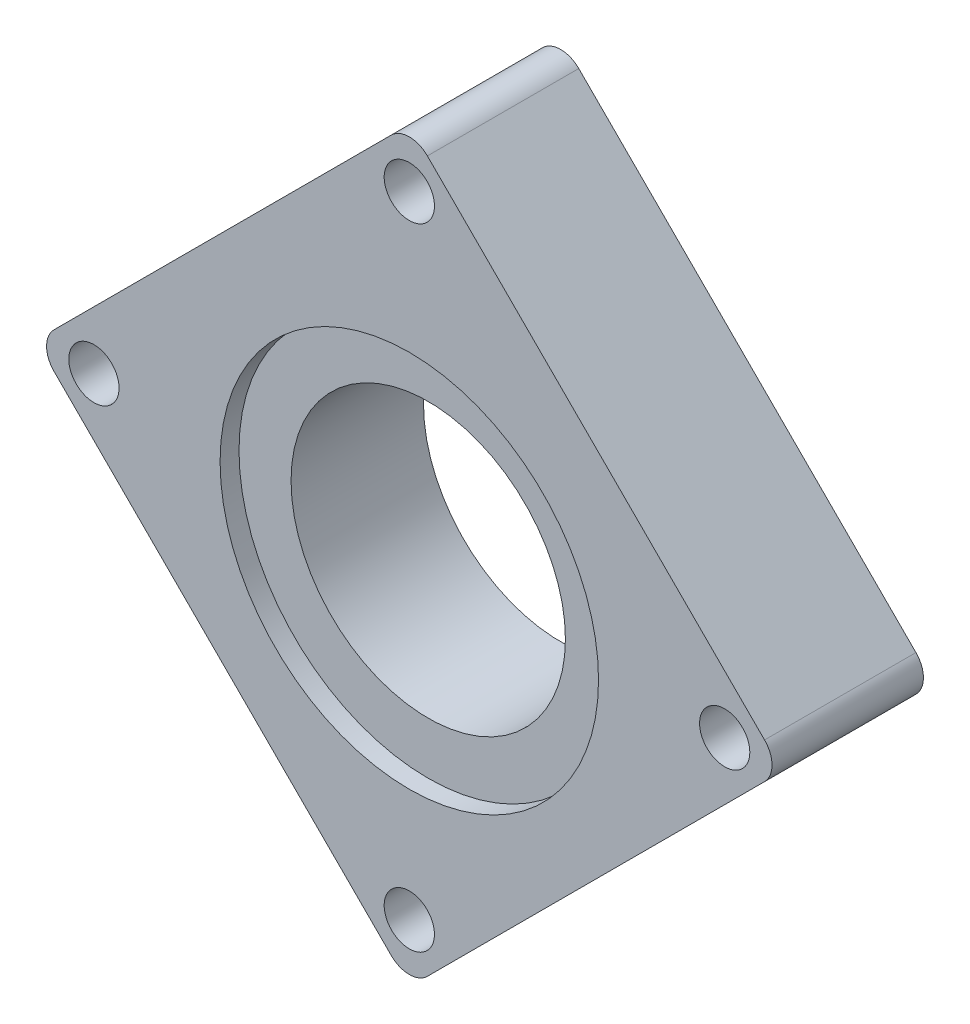
ISO-10303-21;
HEADER;
FILE_DESCRIPTION(('STEP AP214'),'2;1');
FILE_NAME('part.step','',(''),(''),'','','');
FILE_SCHEMA(('AUTOMOTIVE_DESIGN { 1 0 10303 214 1 1 1 1 }'));
ENDSEC;
DATA;
#1=APPLICATION_CONTEXT('core data for automotive mechanical design processes');
#2=APPLICATION_PROTOCOL_DEFINITION('international standard','automotive_design',2000,#1);
#3=PRODUCT_CONTEXT('',#1,'mechanical');
#4=PRODUCT('Part','Part','',(#3));
#5=PRODUCT_RELATED_PRODUCT_CATEGORY('part','',(#4));
#6=PRODUCT_DEFINITION_FORMATION('','',#4);
#7=PRODUCT_DEFINITION_CONTEXT('part definition',#1,'design');
#8=PRODUCT_DEFINITION('design','',#6,#7);
#9=PRODUCT_DEFINITION_SHAPE('','',#8);
#10=(LENGTH_UNIT() NAMED_UNIT(*) SI_UNIT(.MILLI.,.METRE.));
#11=(NAMED_UNIT(*) PLANE_ANGLE_UNIT() SI_UNIT($,.RADIAN.));
#12=(NAMED_UNIT(*) SI_UNIT($,.STERADIAN.) SOLID_ANGLE_UNIT());
#13=UNCERTAINTY_MEASURE_WITH_UNIT(LENGTH_MEASURE(1.E-05),#10,'distance_accuracy_value','');
#14=(GEOMETRIC_REPRESENTATION_CONTEXT(3) GLOBAL_UNCERTAINTY_ASSIGNED_CONTEXT((#13)) GLOBAL_UNIT_ASSIGNED_CONTEXT((#10,
#11,#12)) REPRESENTATION_CONTEXT('',''));
#15=CARTESIAN_POINT('',(0.,0.,0.));
#16=DIRECTION('',(0.,0.,1.));
#17=DIRECTION('',(1.,0.,0.));
#18=AXIS2_PLACEMENT_3D('',#15,#16,#17);
#19=CARTESIAN_POINT('',(58.9093516025737,45.0772658132579,16.));
#20=DIRECTION('',(0.,0.,-1.));
#21=DIRECTION('',(-1.,0.,0.));
#22=AXIS2_PLACEMENT_3D('',#19,#20,#21);
#23=CYLINDRICAL_SURFACE('',#22,14.5);
#24=CARTESIAN_POINT('',(58.9093516025737,45.0772658132579,0.));
#25=DIRECTION('',(0.,0.,1.));
#26=DIRECTION('',(1.,0.,0.));
#27=AXIS2_PLACEMENT_3D('',#24,#25,#26);
#28=CIRCLE('',#27,14.5);
#29=CARTESIAN_POINT('',(73.4093516025737,45.0772658132579,0.));
#30=VERTEX_POINT('',#29);
#31=EDGE_CURVE('E135',#30,#30,#28,.T.);
#32=ORIENTED_EDGE('',*,*,#31,.F.);
#33=EDGE_LOOP('',(#32));
#34=FACE_BOUND('',#33,.T.);
#35=CARTESIAN_POINT('',(58.9093516025737,45.0772658132579,14.));
#36=DIRECTION('',(0.,0.,1.));
#37=DIRECTION('',(1.,0.,0.));
#38=AXIS2_PLACEMENT_3D('',#35,#36,#37);
#39=CIRCLE('',#38,14.5);
#40=CARTESIAN_POINT('',(73.4093516025737,45.0772658132579,14.));
#41=VERTEX_POINT('',#40);
#42=EDGE_CURVE('E36',#41,#41,#39,.T.);
#43=ORIENTED_EDGE('',*,*,#42,.T.);
#44=EDGE_LOOP('',(#43));
#45=FACE_BOUND('',#44,.T.);
#46=ADVANCED_FACE('F32',(#34,#45),#23,.F.);
#47=CARTESIAN_POINT('',(94.5475333743754,46.4576834611031,16.));
#48=DIRECTION('',(0.,0.,1.));
#49=DIRECTION('',(1.,0.,0.));
#50=AXIS2_PLACEMENT_3D('',#47,#48,#49);
#51=PLANE('',#50);
#52=CARTESIAN_POINT('',(58.9093516025737,45.0772658132579,16.));
#53=DIRECTION('',(0.,0.,1.));
#54=DIRECTION('',(1.,0.,0.));
#55=AXIS2_PLACEMENT_3D('',#52,#53,#54);
#56=CIRCLE('',#55,20.);
#57=CARTESIAN_POINT('',(78.9093516025737,45.0772658132579,16.));
#58=VERTEX_POINT('',#57);
#59=EDGE_CURVE('E207',#58,#58,#56,.T.);
#60=ORIENTED_EDGE('',*,*,#59,.F.);
#61=EDGE_LOOP('',(#60));
#62=FACE_BOUND('',#61,.T.);
#63=CARTESIAN_POINT('',(58.9093516025736,79.7906971262372,16.));
#64=DIRECTION('',(0.,0.,1.));
#65=DIRECTION('',(1.,0.,0.));
#66=AXIS2_PLACEMENT_3D('',#63,#64,#65);
#67=CIRCLE('',#66,2.65560296279747);
#68=CARTESIAN_POINT('',(61.564954565371,79.7906971262372,16.));
#69=VERTEX_POINT('',#68);
#70=EDGE_CURVE('E193',#69,#69,#67,.T.);
#71=ORIENTED_EDGE('',*,*,#70,.F.);
#72=EDGE_LOOP('',(#71));
#73=FACE_BOUND('',#72,.T.);
#74=CARTESIAN_POINT('',(58.9093516025732,13.1246697959693,16.));
#75=DIRECTION('',(0.,0.,1.));
#76=DIRECTION('',(1.,0.,0.));
#77=AXIS2_PLACEMENT_3D('',#74,#75,#76);
#78=CIRCLE('',#77,2.65560296279745);
#79=CARTESIAN_POINT('',(61.5649545653707,13.1246697959693,16.));
#80=VERTEX_POINT('',#79);
#81=EDGE_CURVE('E183',#80,#80,#78,.T.);
#82=ORIENTED_EDGE('',*,*,#81,.F.);
#83=EDGE_LOOP('',(#82));
#84=FACE_BOUND('',#83,.T.);
#85=CARTESIAN_POINT('',(94.5475333743754,46.4576834611031,16.));
#86=DIRECTION('',(0.,0.,1.));
#87=DIRECTION('',(1.,0.,0.));
#88=AXIS2_PLACEMENT_3D('',#85,#86,#87);
#89=CIRCLE('',#88,2.7);
#90=CARTESIAN_POINT('',(96.4567216835791,44.5484951518994,16.));
#91=VERTEX_POINT('',#90);
#92=CARTESIAN_POINT('',(96.4567216835791,48.3668717703068,16.));
#93=VERTEX_POINT('',#92);
#94=EDGE_CURVE('E149',#91,#93,#89,.T.);
#95=ORIENTED_EDGE('',*,*,#94,.T.);
#96=DIRECTION('',(-0.707106781186543,0.707106781186552,0.));
#97=VECTOR('',#96,1.);
#98=CARTESIAN_POINT('',(96.4567216835791,48.3668717703068,16.));
#99=LINE('',#98,#97);
#100=CARTESIAN_POINT('',(60.8185399117773,84.005053542109,16.));
#101=VERTEX_POINT('',#100);
#102=EDGE_CURVE('E91',#93,#101,#99,.T.);
#103=ORIENTED_EDGE('',*,*,#102,.T.);
#104=CARTESIAN_POINT('',(58.9093516025737,82.0958652329053,16.));
#105=DIRECTION('',(0.,0.,1.));
#106=DIRECTION('',(1.,0.,0.));
#107=AXIS2_PLACEMENT_3D('',#104,#105,#106);
#108=CIRCLE('',#107,2.69999999999999);
#109=CARTESIAN_POINT('',(57.00016329337,84.005053542109,16.));
#110=VERTEX_POINT('',#109);
#111=EDGE_CURVE('E165',#101,#110,#108,.T.);
#112=ORIENTED_EDGE('',*,*,#111,.T.);
#113=DIRECTION('',(-0.707106781186552,-0.707106781186543,0.));
#114=VECTOR('',#113,1.);
#115=CARTESIAN_POINT('',(57.00016329337,84.005053542109,16.));
#116=LINE('',#115,#114);
#117=CARTESIAN_POINT('',(21.3619815215678,48.3668717703072,16.));
#118=VERTEX_POINT('',#117);
#119=EDGE_CURVE('E175',#110,#118,#116,.T.);
#120=ORIENTED_EDGE('',*,*,#119,.T.);
#121=CARTESIAN_POINT('',(23.2711698307715,46.4576834611035,16.));
#122=DIRECTION('',(0.,0.,1.));
#123=DIRECTION('',(1.,0.,0.));
#124=AXIS2_PLACEMENT_3D('',#121,#122,#123);
#125=CIRCLE('',#124,2.70000000000001);
#126=CARTESIAN_POINT('',(21.3619815215678,44.5484951518999,16.));
#127=VERTEX_POINT('',#126);
#128=EDGE_CURVE('E112',#118,#127,#125,.T.);
#129=ORIENTED_EDGE('',*,*,#128,.T.);
#130=DIRECTION('',(0.707106781186543,-0.707106781186552,0.));
#131=VECTOR('',#130,1.);
#132=CARTESIAN_POINT('',(21.3619815215678,44.5484951518999,16.));
#133=LINE('',#132,#131);
#134=CARTESIAN_POINT('',(57.0001632933695,8.91031338009766,16.));
#135=VERTEX_POINT('',#134);
#136=EDGE_CURVE('E104',#127,#135,#133,.T.);
#137=ORIENTED_EDGE('',*,*,#136,.T.);
#138=CARTESIAN_POINT('',(58.9093516025732,10.8195016893013,16.));
#139=DIRECTION('',(0.,0.,1.));
#140=DIRECTION('',(1.,0.,0.));
#141=AXIS2_PLACEMENT_3D('',#138,#139,#140);
#142=CIRCLE('',#141,2.7);
#143=CARTESIAN_POINT('',(60.8185399117769,8.91031338009764,16.));
#144=VERTEX_POINT('',#143);
#145=EDGE_CURVE('E109',#135,#144,#142,.T.);
#146=ORIENTED_EDGE('',*,*,#145,.T.);
#147=DIRECTION('',(0.707106781186552,0.707106781186543,0.));
#148=VECTOR('',#147,1.);
#149=CARTESIAN_POINT('',(60.8185399117769,8.91031338009764,16.));
#150=LINE('',#149,#148);
#151=EDGE_CURVE('E50',#144,#91,#150,.T.);
#152=ORIENTED_EDGE('',*,*,#151,.T.);
#153=EDGE_LOOP('',(#95,#103,#112,#120,#129,#137,#146,#152));
#154=FACE_BOUND('',#153,.T.);
#155=CARTESIAN_POINT('',(92.2423652677073,46.4576834611031,16.));
#156=DIRECTION('',(0.,0.,1.));
#157=DIRECTION('',(1.,0.,0.));
#158=AXIS2_PLACEMENT_3D('',#155,#156,#157);
#159=CIRCLE('',#158,2.65560296279748);
#160=CARTESIAN_POINT('',(94.8979682305048,46.4576834611031,16.));
#161=VERTEX_POINT('',#160);
#162=EDGE_CURVE('E187',#161,#161,#159,.T.);
#163=ORIENTED_EDGE('',*,*,#162,.F.);
#164=EDGE_LOOP('',(#163));
#165=FACE_BOUND('',#164,.T.);
#166=CARTESIAN_POINT('',(25.5763379374397,46.4576834611035,16.));
#167=DIRECTION('',(0.,0.,1.));
#168=DIRECTION('',(1.,0.,0.));
#169=AXIS2_PLACEMENT_3D('',#166,#167,#168);
#170=CIRCLE('',#169,2.65560296279746);
#171=CARTESIAN_POINT('',(28.2319409002371,46.4576834611035,16.));
#172=VERTEX_POINT('',#171);
#173=EDGE_CURVE('E199',#172,#172,#170,.T.);
#174=ORIENTED_EDGE('',*,*,#173,.F.);
#175=EDGE_LOOP('',(#174));
#176=FACE_BOUND('',#175,.T.);
#177=ADVANCED_FACE('F106',(#62,#73,#84,#154,#165,#176),#51,.T.);
#178=CARTESIAN_POINT('',(94.5475333743754,46.4576834611031,0.));
#179=DIRECTION('',(0.,0.,1.));
#180=DIRECTION('',(1.,0.,0.));
#181=AXIS2_PLACEMENT_3D('',#178,#179,#180);
#182=PLANE('',#181);
#183=CARTESIAN_POINT('',(94.5475333743754,46.4576834611031,0.));
#184=DIRECTION('',(0.,0.,1.));
#185=DIRECTION('',(1.,0.,0.));
#186=AXIS2_PLACEMENT_3D('',#183,#184,#185);
#187=CIRCLE('',#186,2.7);
#188=CARTESIAN_POINT('',(96.4567216835791,44.5484951518994,0.));
#189=VERTEX_POINT('',#188);
#190=CARTESIAN_POINT('',(96.4567216835791,48.3668717703068,0.));
#191=VERTEX_POINT('',#190);
#192=EDGE_CURVE('E131',#189,#191,#187,.T.);
#193=ORIENTED_EDGE('',*,*,#192,.F.);
#194=DIRECTION('',(0.707106781186552,0.707106781186543,0.));
#195=VECTOR('',#194,1.);
#196=CARTESIAN_POINT('',(92.4262130308157,40.5179864991361,0.));
#197=LINE('',#196,#195);
#198=CARTESIAN_POINT('',(60.8185399117769,8.91031338009764,0.));
#199=VERTEX_POINT('',#198);
#200=EDGE_CURVE('E79',#199,#189,#197,.T.);
#201=ORIENTED_EDGE('',*,*,#200,.F.);
#202=CARTESIAN_POINT('',(58.9093516025732,10.8195016893013,0.));
#203=DIRECTION('',(0.,0.,1.));
#204=DIRECTION('',(1.,0.,0.));
#205=AXIS2_PLACEMENT_3D('',#202,#203,#204);
#206=CIRCLE('',#205,2.7);
#207=CARTESIAN_POINT('',(57.0001632933695,8.91031338009766,0.));
#208=VERTEX_POINT('',#207);
#209=EDGE_CURVE('E146',#208,#199,#206,.T.);
#210=ORIENTED_EDGE('',*,*,#209,.F.);
#211=DIRECTION('',(0.707106781186543,-0.707106781186552,0.));
#212=VECTOR('',#211,1.);
#213=CARTESIAN_POINT('',(52.9696546406062,12.940822032861,0.));
#214=LINE('',#213,#212);
#215=CARTESIAN_POINT('',(21.3619815215678,44.5484951518999,0.));
#216=VERTEX_POINT('',#215);
#217=EDGE_CURVE('E120',#216,#208,#214,.T.);
#218=ORIENTED_EDGE('',*,*,#217,.F.);
#219=CARTESIAN_POINT('',(23.2711698307715,46.4576834611035,0.));
#220=DIRECTION('',(0.,0.,1.));
#221=DIRECTION('',(1.,0.,0.));
#222=AXIS2_PLACEMENT_3D('',#219,#220,#221);
#223=CIRCLE('',#222,2.70000000000001);
#224=CARTESIAN_POINT('',(21.3619815215678,48.3668717703072,0.));
#225=VERTEX_POINT('',#224);
#226=EDGE_CURVE('E142',#225,#216,#223,.T.);
#227=ORIENTED_EDGE('',*,*,#226,.F.);
#228=DIRECTION('',(-0.707106781186553,-0.707106781186542,0.));
#229=VECTOR('',#228,1.);
#230=CARTESIAN_POINT('',(25.3924901743311,52.3973804230705,0.));
#231=LINE('',#230,#229);
#232=CARTESIAN_POINT('',(57.00016329337,84.005053542109,0.));
#233=VERTEX_POINT('',#232);
#234=EDGE_CURVE('E140',#233,#225,#231,.T.);
#235=ORIENTED_EDGE('',*,*,#234,.F.);
#236=CARTESIAN_POINT('',(58.9093516025737,82.0958652329053,0.));
#237=DIRECTION('',(0.,0.,1.));
#238=DIRECTION('',(1.,0.,0.));
#239=AXIS2_PLACEMENT_3D('',#236,#237,#238);
#240=CIRCLE('',#239,2.69999999999999);
#241=CARTESIAN_POINT('',(60.8185399117773,84.005053542109,0.));
#242=VERTEX_POINT('',#241);
#243=EDGE_CURVE('E137',#242,#233,#240,.T.);
#244=ORIENTED_EDGE('',*,*,#243,.F.);
#245=DIRECTION('',(-0.707106781186543,0.707106781186552,0.));
#246=VECTOR('',#245,1.);
#247=CARTESIAN_POINT('',(64.8490485645406,79.9745448893457,0.));
#248=LINE('',#247,#246);
#249=EDGE_CURVE('E134',#191,#242,#248,.T.);
#250=ORIENTED_EDGE('',*,*,#249,.F.);
#251=EDGE_LOOP('',(#193,#201,#210,#218,#227,#235,#244,#250));
#252=FACE_BOUND('',#251,.T.);
#253=ORIENTED_EDGE('',*,*,#31,.T.);
#254=EDGE_LOOP('',(#253));
#255=FACE_BOUND('',#254,.T.);
#256=CARTESIAN_POINT('',(58.9093516025732,13.1246697959693,0.));
#257=DIRECTION('',(0.,0.,1.));
#258=DIRECTION('',(1.,0.,0.));
#259=AXIS2_PLACEMENT_3D('',#256,#257,#258);
#260=CIRCLE('',#259,2.65560296279745);
#261=CARTESIAN_POINT('',(61.5649545653707,13.1246697959693,0.));
#262=VERTEX_POINT('',#261);
#263=EDGE_CURVE('E184',#262,#262,#260,.T.);
#264=ORIENTED_EDGE('',*,*,#263,.T.);
#265=EDGE_LOOP('',(#264));
#266=FACE_BOUND('',#265,.T.);
#267=CARTESIAN_POINT('',(92.2423652677073,46.4576834611031,0.));
#268=DIRECTION('',(0.,0.,1.));
#269=DIRECTION('',(1.,0.,0.));
#270=AXIS2_PLACEMENT_3D('',#267,#268,#269);
#271=CIRCLE('',#270,2.65560296279748);
#272=CARTESIAN_POINT('',(94.8979682305048,46.4576834611031,0.));
#273=VERTEX_POINT('',#272);
#274=EDGE_CURVE('E190',#273,#273,#271,.T.);
#275=ORIENTED_EDGE('',*,*,#274,.T.);
#276=EDGE_LOOP('',(#275));
#277=FACE_BOUND('',#276,.T.);
#278=CARTESIAN_POINT('',(58.9093516025736,79.7906971262372,0.));
#279=DIRECTION('',(0.,0.,1.));
#280=DIRECTION('',(1.,0.,0.));
#281=AXIS2_PLACEMENT_3D('',#278,#279,#280);
#282=CIRCLE('',#281,2.65560296279747);
#283=CARTESIAN_POINT('',(61.564954565371,79.7906971262372,0.));
#284=VERTEX_POINT('',#283);
#285=EDGE_CURVE('E196',#284,#284,#282,.T.);
#286=ORIENTED_EDGE('',*,*,#285,.T.);
#287=EDGE_LOOP('',(#286));
#288=FACE_BOUND('',#287,.T.);
#289=CARTESIAN_POINT('',(25.5763379374397,46.4576834611035,0.));
#290=DIRECTION('',(0.,0.,1.));
#291=DIRECTION('',(1.,0.,0.));
#292=AXIS2_PLACEMENT_3D('',#289,#290,#291);
#293=CIRCLE('',#292,2.65560296279746);
#294=CARTESIAN_POINT('',(28.2319409002371,46.4576834611035,0.));
#295=VERTEX_POINT('',#294);
#296=EDGE_CURVE('E202',#295,#295,#293,.T.);
#297=ORIENTED_EDGE('',*,*,#296,.T.);
#298=EDGE_LOOP('',(#297));
#299=FACE_BOUND('',#298,.T.);
#300=ADVANCED_FACE('F166',(#252,#255,#266,#277,#288,#299),#182,.F.);
#301=CARTESIAN_POINT('',(94.5475333743754,46.4576834611031,16.));
#302=DIRECTION('',(0.,0.,-1.));
#303=DIRECTION('',(-1.,0.,0.));
#304=AXIS2_PLACEMENT_3D('',#301,#302,#303);
#305=CYLINDRICAL_SURFACE('',#304,2.7);
#306=ORIENTED_EDGE('',*,*,#192,.T.);
#307=DIRECTION('',(0.,0.,-1.));
#308=VECTOR('',#307,1.);
#309=CARTESIAN_POINT('',(96.4567216835791,48.3668717703068,16.));
#310=LINE('',#309,#308);
#311=EDGE_CURVE('E11',#93,#191,#310,.T.);
#312=ORIENTED_EDGE('',*,*,#311,.F.);
#313=ORIENTED_EDGE('',*,*,#94,.F.);
#314=DIRECTION('',(0.,0.,-1.));
#315=VECTOR('',#314,1.);
#316=CARTESIAN_POINT('',(96.4567216835791,44.5484951518994,16.));
#317=LINE('',#316,#315);
#318=EDGE_CURVE('E127',#91,#189,#317,.T.);
#319=ORIENTED_EDGE('',*,*,#318,.T.);
#320=EDGE_LOOP('',(#306,#312,#313,#319));
#321=FACE_BOUND('',#320,.T.);
#322=ADVANCED_FACE('F34',(#321),#305,.T.);
#323=CARTESIAN_POINT('',(64.8490485645406,79.9745448893457,16.));
#324=DIRECTION('',(-0.707106781186552,-0.707106781186543,0.));
#325=DIRECTION('',(0.707106781186543,-0.707106781186552,0.));
#326=AXIS2_PLACEMENT_3D('',#323,#324,#325);
#327=PLANE('',#326);
#328=ORIENTED_EDGE('',*,*,#249,.T.);
#329=DIRECTION('',(0.,0.,-1.));
#330=VECTOR('',#329,1.);
#331=CARTESIAN_POINT('',(60.8185399117773,84.005053542109,16.));
#332=LINE('',#331,#330);
#333=EDGE_CURVE('E42',#101,#242,#332,.T.);
#334=ORIENTED_EDGE('',*,*,#333,.F.);
#335=ORIENTED_EDGE('',*,*,#102,.F.);
#336=ORIENTED_EDGE('',*,*,#311,.T.);
#337=EDGE_LOOP('',(#328,#334,#335,#336));
#338=FACE_BOUND('',#337,.T.);
#339=ADVANCED_FACE('F255',(#338),#327,.F.);
#340=CARTESIAN_POINT('',(58.9093516025737,82.0958652329053,16.));
#341=DIRECTION('',(0.,0.,-1.));
#342=DIRECTION('',(-1.,0.,0.));
#343=AXIS2_PLACEMENT_3D('',#340,#341,#342);
#344=CYLINDRICAL_SURFACE('',#343,2.69999999999999);
#345=ORIENTED_EDGE('',*,*,#243,.T.);
#346=DIRECTION('',(0.,0.,-1.));
#347=VECTOR('',#346,1.);
#348=CARTESIAN_POINT('',(57.00016329337,84.005053542109,16.));
#349=LINE('',#348,#347);
#350=EDGE_CURVE('E156',#110,#233,#349,.T.);
#351=ORIENTED_EDGE('',*,*,#350,.F.);
#352=ORIENTED_EDGE('',*,*,#111,.F.);
#353=ORIENTED_EDGE('',*,*,#333,.T.);
#354=EDGE_LOOP('',(#345,#351,#352,#353));
#355=FACE_BOUND('',#354,.T.);
#356=ADVANCED_FACE('F163',(#355),#344,.T.);
#357=CARTESIAN_POINT('',(25.3924901743311,52.3973804230705,16.));
#358=DIRECTION('',(0.707106781186542,-0.707106781186553,0.));
#359=DIRECTION('',(0.707106781186553,0.707106781186542,0.));
#360=AXIS2_PLACEMENT_3D('',#357,#358,#359);
#361=PLANE('',#360);
#362=ORIENTED_EDGE('',*,*,#234,.T.);
#363=DIRECTION('',(0.,0.,-1.));
#364=VECTOR('',#363,1.);
#365=CARTESIAN_POINT('',(21.3619815215678,48.3668717703072,16.));
#366=LINE('',#365,#364);
#367=EDGE_CURVE('E153',#118,#225,#366,.T.);
#368=ORIENTED_EDGE('',*,*,#367,.F.);
#369=ORIENTED_EDGE('',*,*,#119,.F.);
#370=ORIENTED_EDGE('',*,*,#350,.T.);
#371=EDGE_LOOP('',(#362,#368,#369,#370));
#372=FACE_BOUND('',#371,.T.);
#373=ADVANCED_FACE('F171',(#372),#361,.F.);
#374=CARTESIAN_POINT('',(23.2711698307715,46.4576834611035,16.));
#375=DIRECTION('',(0.,0.,-1.));
#376=DIRECTION('',(-1.,0.,0.));
#377=AXIS2_PLACEMENT_3D('',#374,#375,#376);
#378=CYLINDRICAL_SURFACE('',#377,2.70000000000001);
#379=ORIENTED_EDGE('',*,*,#226,.T.);
#380=DIRECTION('',(0.,0.,-1.));
#381=VECTOR('',#380,1.);
#382=CARTESIAN_POINT('',(21.3619815215678,44.5484951518999,16.));
#383=LINE('',#382,#381);
#384=EDGE_CURVE('E122',#127,#216,#383,.T.);
#385=ORIENTED_EDGE('',*,*,#384,.F.);
#386=ORIENTED_EDGE('',*,*,#128,.F.);
#387=ORIENTED_EDGE('',*,*,#367,.T.);
#388=EDGE_LOOP('',(#379,#385,#386,#387));
#389=FACE_BOUND('',#388,.T.);
#390=ADVANCED_FACE('F174',(#389),#378,.T.);
#391=CARTESIAN_POINT('',(52.9696546406062,12.940822032861,16.));
#392=DIRECTION('',(0.707106781186552,0.707106781186543,0.));
#393=DIRECTION('',(-0.707106781186543,0.707106781186552,0.));
#394=AXIS2_PLACEMENT_3D('',#391,#392,#393);
#395=PLANE('',#394);
#396=ORIENTED_EDGE('',*,*,#217,.T.);
#397=DIRECTION('',(0.,0.,-1.));
#398=VECTOR('',#397,1.);
#399=CARTESIAN_POINT('',(57.0001632933695,8.91031338009766,16.));
#400=LINE('',#399,#398);
#401=EDGE_CURVE('E118',#135,#208,#400,.T.);
#402=ORIENTED_EDGE('',*,*,#401,.F.);
#403=ORIENTED_EDGE('',*,*,#136,.F.);
#404=ORIENTED_EDGE('',*,*,#384,.T.);
#405=EDGE_LOOP('',(#396,#402,#403,#404));
#406=FACE_BOUND('',#405,.T.);
#407=ADVANCED_FACE('F119',(#406),#395,.F.);
#408=CARTESIAN_POINT('',(58.9093516025732,10.8195016893013,16.));
#409=DIRECTION('',(0.,0.,-1.));
#410=DIRECTION('',(-1.,0.,0.));
#411=AXIS2_PLACEMENT_3D('',#408,#409,#410);
#412=CYLINDRICAL_SURFACE('',#411,2.7);
#413=ORIENTED_EDGE('',*,*,#209,.T.);
#414=DIRECTION('',(0.,0.,-1.));
#415=VECTOR('',#414,1.);
#416=CARTESIAN_POINT('',(60.8185399117769,8.91031338009764,16.));
#417=LINE('',#416,#415);
#418=EDGE_CURVE('E123',#144,#199,#417,.T.);
#419=ORIENTED_EDGE('',*,*,#418,.F.);
#420=ORIENTED_EDGE('',*,*,#145,.F.);
#421=ORIENTED_EDGE('',*,*,#401,.T.);
#422=EDGE_LOOP('',(#413,#419,#420,#421));
#423=FACE_BOUND('',#422,.T.);
#424=ADVANCED_FACE('F125',(#423),#412,.T.);
#425=CARTESIAN_POINT('',(92.4262130308157,40.5179864991361,16.));
#426=DIRECTION('',(-0.707106781186543,0.707106781186552,0.));
#427=DIRECTION('',(-0.707106781186552,-0.707106781186543,0.));
#428=AXIS2_PLACEMENT_3D('',#425,#426,#427);
#429=PLANE('',#428);
#430=ORIENTED_EDGE('',*,*,#200,.T.);
#431=ORIENTED_EDGE('',*,*,#318,.F.);
#432=ORIENTED_EDGE('',*,*,#151,.F.);
#433=ORIENTED_EDGE('',*,*,#418,.T.);
#434=EDGE_LOOP('',(#430,#431,#432,#433));
#435=FACE_BOUND('',#434,.T.);
#436=ADVANCED_FACE('F243',(#435),#429,.F.);
#437=CARTESIAN_POINT('',(58.9093516025732,13.1246697959693,16.));
#438=DIRECTION('',(0.,0.,-1.));
#439=DIRECTION('',(-1.,0.,0.));
#440=AXIS2_PLACEMENT_3D('',#437,#438,#439);
#441=CYLINDRICAL_SURFACE('',#440,2.65560296279745);
#442=ORIENTED_EDGE('',*,*,#81,.T.);
#443=EDGE_LOOP('',(#442));
#444=FACE_BOUND('',#443,.T.);
#445=ORIENTED_EDGE('',*,*,#263,.F.);
#446=EDGE_LOOP('',(#445));
#447=FACE_BOUND('',#446,.T.);
#448=ADVANCED_FACE('F238',(#444,#447),#441,.F.);
#449=CARTESIAN_POINT('',(92.2423652677073,46.4576834611031,16.));
#450=DIRECTION('',(0.,0.,-1.));
#451=DIRECTION('',(-1.,0.,0.));
#452=AXIS2_PLACEMENT_3D('',#449,#450,#451);
#453=CYLINDRICAL_SURFACE('',#452,2.65560296279748);
#454=ORIENTED_EDGE('',*,*,#162,.T.);
#455=EDGE_LOOP('',(#454));
#456=FACE_BOUND('',#455,.T.);
#457=ORIENTED_EDGE('',*,*,#274,.F.);
#458=EDGE_LOOP('',(#457));
#459=FACE_BOUND('',#458,.T.);
#460=ADVANCED_FACE('F301',(#456,#459),#453,.F.);
#461=CARTESIAN_POINT('',(58.9093516025736,79.7906971262372,16.));
#462=DIRECTION('',(0.,0.,-1.));
#463=DIRECTION('',(-1.,0.,0.));
#464=AXIS2_PLACEMENT_3D('',#461,#462,#463);
#465=CYLINDRICAL_SURFACE('',#464,2.65560296279747);
#466=ORIENTED_EDGE('',*,*,#70,.T.);
#467=EDGE_LOOP('',(#466));
#468=FACE_BOUND('',#467,.T.);
#469=ORIENTED_EDGE('',*,*,#285,.F.);
#470=EDGE_LOOP('',(#469));
#471=FACE_BOUND('',#470,.T.);
#472=ADVANCED_FACE('F293',(#468,#471),#465,.F.);
#473=CARTESIAN_POINT('',(25.5763379374397,46.4576834611035,16.));
#474=DIRECTION('',(0.,0.,-1.));
#475=DIRECTION('',(-1.,0.,0.));
#476=AXIS2_PLACEMENT_3D('',#473,#474,#475);
#477=CYLINDRICAL_SURFACE('',#476,2.65560296279746);
#478=ORIENTED_EDGE('',*,*,#173,.T.);
#479=EDGE_LOOP('',(#478));
#480=FACE_BOUND('',#479,.T.);
#481=ORIENTED_EDGE('',*,*,#296,.F.);
#482=EDGE_LOOP('',(#481));
#483=FACE_BOUND('',#482,.T.);
#484=ADVANCED_FACE('F225',(#480,#483),#477,.F.);
#485=CARTESIAN_POINT('',(58.9093516025737,45.0772658132579,14.));
#486=DIRECTION('',(0.,0.,1.));
#487=DIRECTION('',(1.,0.,0.));
#488=AXIS2_PLACEMENT_3D('',#485,#486,#487);
#489=CYLINDRICAL_SURFACE('',#488,20.);
#490=CARTESIAN_POINT('',(58.9093516025737,45.0772658132579,14.));
#491=DIRECTION('',(0.,0.,1.));
#492=DIRECTION('',(1.,0.,0.));
#493=AXIS2_PLACEMENT_3D('',#490,#491,#492);
#494=CIRCLE('',#493,20.);
#495=CARTESIAN_POINT('',(78.9093516025737,45.0772658132579,14.));
#496=VERTEX_POINT('',#495);
#497=EDGE_CURVE('E210',#496,#496,#494,.T.);
#498=ORIENTED_EDGE('',*,*,#497,.F.);
#499=EDGE_LOOP('',(#498));
#500=FACE_BOUND('',#499,.T.);
#501=ORIENTED_EDGE('',*,*,#59,.T.);
#502=EDGE_LOOP('',(#501));
#503=FACE_BOUND('',#502,.T.);
#504=ADVANCED_FACE('F220',(#500,#503),#489,.F.);
#505=CARTESIAN_POINT('',(58.9093516025737,45.0772658132579,14.));
#506=DIRECTION('',(0.,0.,1.));
#507=DIRECTION('',(1.,0.,0.));
#508=AXIS2_PLACEMENT_3D('',#505,#506,#507);
#509=PLANE('',#508);
#510=ORIENTED_EDGE('',*,*,#42,.F.);
#511=EDGE_LOOP('',(#510));
#512=FACE_BOUND('',#511,.T.);
#513=ORIENTED_EDGE('',*,*,#497,.T.);
#514=EDGE_LOOP('',(#513));
#515=FACE_BOUND('',#514,.T.);
#516=ADVANCED_FACE('F218',(#512,#515),#509,.T.);
#517=CLOSED_SHELL('',(#46,#177,#300,#322,#339,#356,#373,#390,#407,#424,#436,#448,#460,#472,#484,
#504,#516));
#518=MANIFOLD_SOLID_BREP('B2',#517);
#519=ADVANCED_BREP_SHAPE_REPRESENTATION('',(#18,#518),#14);
#520=SHAPE_DEFINITION_REPRESENTATION(#9,#519);
ENDSEC;
END-ISO-10303-21;
